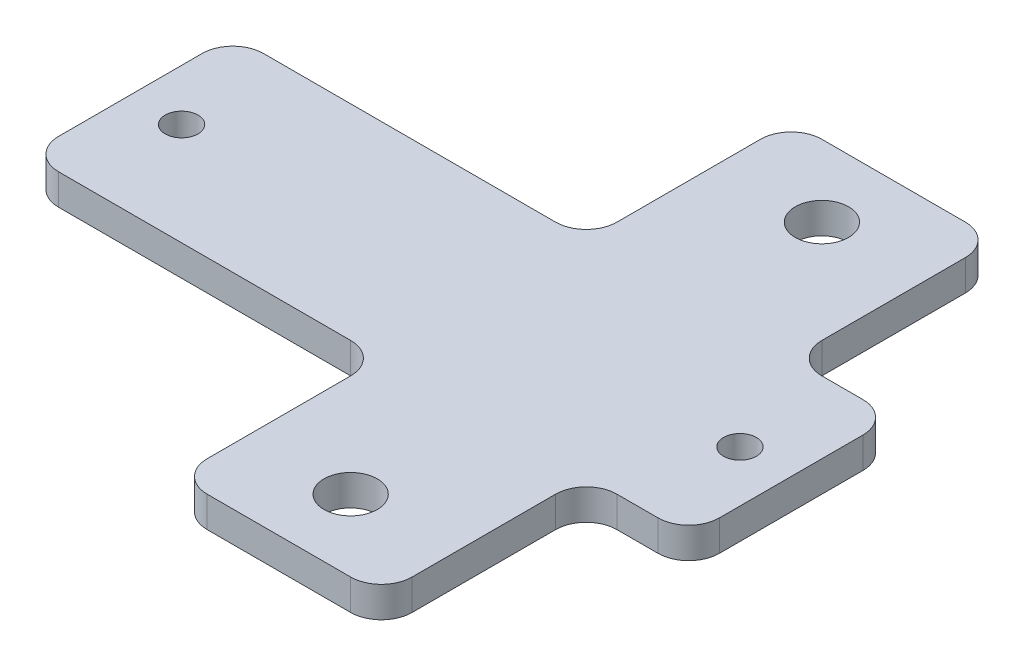
ISO-10303-21;
HEADER;
FILE_DESCRIPTION(('STEP AP214'),'2;1');
FILE_NAME('part.step','',(''),(''),'','','');
FILE_SCHEMA(('AUTOMOTIVE_DESIGN { 1 0 10303 214 1 1 1 1 }'));
ENDSEC;
DATA;
#1=APPLICATION_CONTEXT('core data for automotive mechanical design processes');
#2=APPLICATION_PROTOCOL_DEFINITION('international standard','automotive_design',2000,#1);
#3=PRODUCT_CONTEXT('',#1,'mechanical');
#4=PRODUCT('Part','Part','',(#3));
#5=PRODUCT_RELATED_PRODUCT_CATEGORY('part','',(#4));
#6=PRODUCT_DEFINITION_FORMATION('','',#4);
#7=PRODUCT_DEFINITION_CONTEXT('part definition',#1,'design');
#8=PRODUCT_DEFINITION('design','',#6,#7);
#9=PRODUCT_DEFINITION_SHAPE('','',#8);
#10=(LENGTH_UNIT() NAMED_UNIT(*) SI_UNIT(.MILLI.,.METRE.));
#11=(NAMED_UNIT(*) PLANE_ANGLE_UNIT() SI_UNIT($,.RADIAN.));
#12=(NAMED_UNIT(*) SI_UNIT($,.STERADIAN.) SOLID_ANGLE_UNIT());
#13=UNCERTAINTY_MEASURE_WITH_UNIT(LENGTH_MEASURE(1.E-05),#10,'distance_accuracy_value','');
#14=(GEOMETRIC_REPRESENTATION_CONTEXT(3) GLOBAL_UNCERTAINTY_ASSIGNED_CONTEXT((#13)) GLOBAL_UNIT_ASSIGNED_CONTEXT((#10,
#11,#12)) REPRESENTATION_CONTEXT('',''));
#15=CARTESIAN_POINT('',(0.,0.,0.));
#16=DIRECTION('',(0.,0.,1.));
#17=DIRECTION('',(1.,0.,0.));
#18=AXIS2_PLACEMENT_3D('',#15,#16,#17);
#19=CARTESIAN_POINT('',(20.,3.,0.));
#20=DIRECTION('',(-1.,0.,0.));
#21=DIRECTION('',(0.,0.,1.));
#22=AXIS2_PLACEMENT_3D('',#19,#20,#21);
#23=PLANE('',#22);
#24=DIRECTION('',(0.,0.,-1.));
#25=VECTOR('',#24,1.);
#26=CARTESIAN_POINT('',(20.,0.,0.));
#27=LINE('',#26,#25);
#28=CARTESIAN_POINT('',(20.,0.,-43.));
#29=VERTEX_POINT('',#28);
#30=CARTESIAN_POINT('',(20.,0.,-57.));
#31=VERTEX_POINT('',#30);
#32=EDGE_CURVE('E351',#29,#31,#27,.T.);
#33=ORIENTED_EDGE('',*,*,#32,.T.);
#34=DIRECTION('',(0.,-1.,0.));
#35=VECTOR('',#34,1.);
#36=CARTESIAN_POINT('',(20.,3.,-57.));
#37=LINE('',#36,#35);
#38=CARTESIAN_POINT('',(20.,3.,-57.));
#39=VERTEX_POINT('',#38);
#40=EDGE_CURVE('E242',#31,#39,#37,.F.);
#41=ORIENTED_EDGE('',*,*,#40,.T.);
#42=DIRECTION('',(0.,0.,-1.));
#43=VECTOR('',#42,1.);
#44=CARTESIAN_POINT('',(20.,3.,0.));
#45=LINE('',#44,#43);
#46=CARTESIAN_POINT('',(20.,3.,-43.));
#47=VERTEX_POINT('',#46);
#48=EDGE_CURVE('E340',#47,#39,#45,.T.);
#49=ORIENTED_EDGE('',*,*,#48,.F.);
#50=DIRECTION('',(0.,1.,0.));
#51=VECTOR('',#50,1.);
#52=CARTESIAN_POINT('',(20.,3.,-43.));
#53=LINE('',#52,#51);
#54=EDGE_CURVE('E240',#47,#29,#53,.F.);
#55=ORIENTED_EDGE('',*,*,#54,.T.);
#56=EDGE_LOOP('',(#33,#41,#49,#55));
#57=FACE_BOUND('',#56,.T.);
#58=ADVANCED_FACE('F34',(#57),#23,.F.);
#59=CARTESIAN_POINT('',(0.,3.,0.));
#60=DIRECTION('',(1.,0.,0.));
#61=DIRECTION('',(0.,0.,-1.));
#62=AXIS2_PLACEMENT_3D('',#59,#60,#61);
#63=PLANE('',#62);
#64=DIRECTION('',(0.,0.,1.));
#65=VECTOR('',#64,1.);
#66=CARTESIAN_POINT('',(0.,3.,0.));
#67=LINE('',#66,#65);
#68=CARTESIAN_POINT('',(0.,3.,-17.));
#69=VERTEX_POINT('',#68);
#70=CARTESIAN_POINT('',(0.,3.,-3.));
#71=VERTEX_POINT('',#70);
#72=EDGE_CURVE('E291',#69,#71,#67,.T.);
#73=ORIENTED_EDGE('',*,*,#72,.F.);
#74=DIRECTION('',(0.,1.,0.));
#75=VECTOR('',#74,1.);
#76=CARTESIAN_POINT('',(0.,3.,-17.));
#77=LINE('',#76,#75);
#78=CARTESIAN_POINT('',(0.,0.,-17.));
#79=VERTEX_POINT('',#78);
#80=EDGE_CURVE('E272',#69,#79,#77,.F.);
#81=ORIENTED_EDGE('',*,*,#80,.T.);
#82=DIRECTION('',(0.,0.,1.));
#83=VECTOR('',#82,1.);
#84=CARTESIAN_POINT('',(0.,0.,0.));
#85=LINE('',#84,#83);
#86=CARTESIAN_POINT('',(0.,0.,-3.));
#87=VERTEX_POINT('',#86);
#88=EDGE_CURVE('E311',#79,#87,#85,.T.);
#89=ORIENTED_EDGE('',*,*,#88,.T.);
#90=DIRECTION('',(0.,-1.,0.));
#91=VECTOR('',#90,1.);
#92=CARTESIAN_POINT('',(0.,3.,-3.));
#93=LINE('',#92,#91);
#94=EDGE_CURVE('E270',#87,#71,#93,.F.);
#95=ORIENTED_EDGE('',*,*,#94,.T.);
#96=EDGE_LOOP('',(#73,#81,#89,#95));
#97=FACE_BOUND('',#96,.T.);
#98=ADVANCED_FACE('F300',(#97),#63,.F.);
#99=CARTESIAN_POINT('',(0.,3.,0.));
#100=DIRECTION('',(0.,-1.,0.));
#101=DIRECTION('',(0.,0.,-1.));
#102=AXIS2_PLACEMENT_3D('',#99,#100,#101);
#103=PLANE('',#102);
#104=DIRECTION('',(0.,0.,1.));
#105=VECTOR('',#104,1.);
#106=CARTESIAN_POINT('',(-34.5,3.,-20.));
#107=LINE('',#106,#105);
#108=CARTESIAN_POINT('',(-34.5,3.,-37.));
#109=VERTEX_POINT('',#108);
#110=CARTESIAN_POINT('',(-34.5,3.,-23.));
#111=VERTEX_POINT('',#110);
#112=EDGE_CURVE('E203',#109,#111,#107,.T.);
#113=ORIENTED_EDGE('',*,*,#112,.T.);
#114=CARTESIAN_POINT('',(-31.5,3.,-23.));
#115=DIRECTION('',(0.,-1.,0.));
#116=DIRECTION('',(0.,0.,-1.));
#117=AXIS2_PLACEMENT_3D('',#114,#115,#116);
#118=CIRCLE('',#117,3.);
#119=CARTESIAN_POINT('',(-31.5,3.,-20.));
#120=VERTEX_POINT('',#119);
#121=EDGE_CURVE('E372',#111,#120,#118,.F.);
#122=ORIENTED_EDGE('',*,*,#121,.T.);
#123=DIRECTION('',(1.,0.,0.));
#124=VECTOR('',#123,1.);
#125=CARTESIAN_POINT('',(0.,3.,-20.));
#126=LINE('',#125,#124);
#127=CARTESIAN_POINT('',(-3.,3.,-20.));
#128=VERTEX_POINT('',#127);
#129=EDGE_CURVE('E294',#120,#128,#126,.T.);
#130=ORIENTED_EDGE('',*,*,#129,.T.);
#131=CARTESIAN_POINT('',(-3.,3.,-17.));
#132=DIRECTION('',(0.,-1.,0.));
#133=DIRECTION('',(0.,0.,-1.));
#134=AXIS2_PLACEMENT_3D('',#131,#132,#133);
#135=CIRCLE('',#134,3.);
#136=EDGE_CURVE('E42',#128,#69,#135,.T.);
#137=ORIENTED_EDGE('',*,*,#136,.T.);
#138=ORIENTED_EDGE('',*,*,#72,.T.);
#139=CARTESIAN_POINT('',(3.,3.,-3.));
#140=DIRECTION('',(0.,-1.,0.));
#141=DIRECTION('',(0.,0.,-1.));
#142=AXIS2_PLACEMENT_3D('',#139,#140,#141);
#143=CIRCLE('',#142,3.);
#144=CARTESIAN_POINT('',(3.,3.,0.));
#145=VERTEX_POINT('',#144);
#146=EDGE_CURVE('E358',#71,#145,#143,.F.);
#147=ORIENTED_EDGE('',*,*,#146,.T.);
#148=DIRECTION('',(1.,0.,0.));
#149=VECTOR('',#148,1.);
#150=CARTESIAN_POINT('',(0.,3.,0.));
#151=LINE('',#150,#149);
#152=CARTESIAN_POINT('',(17.,3.,0.));
#153=VERTEX_POINT('',#152);
#154=EDGE_CURVE('E337',#145,#153,#151,.T.);
#155=ORIENTED_EDGE('',*,*,#154,.T.);
#156=CARTESIAN_POINT('',(17.,3.,-3.));
#157=DIRECTION('',(0.,-1.,0.));
#158=DIRECTION('',(0.,0.,-1.));
#159=AXIS2_PLACEMENT_3D('',#156,#157,#158);
#160=CIRCLE('',#159,3.);
#161=CARTESIAN_POINT('',(20.,3.,-3.));
#162=VERTEX_POINT('',#161);
#163=EDGE_CURVE('E360',#153,#162,#160,.F.);
#164=ORIENTED_EDGE('',*,*,#163,.T.);
#165=CARTESIAN_POINT('',(20.,3.,-17.));
#166=VERTEX_POINT('',#165);
#167=EDGE_CURVE('E343',#162,#166,#45,.T.);
#168=ORIENTED_EDGE('',*,*,#167,.T.);
#169=CARTESIAN_POINT('',(23.,3.,-17.));
#170=DIRECTION('',(0.,-1.,0.));
#171=DIRECTION('',(0.,0.,-1.));
#172=AXIS2_PLACEMENT_3D('',#169,#170,#171);
#173=CIRCLE('',#172,3.);
#174=CARTESIAN_POINT('',(23.,3.,-20.));
#175=VERTEX_POINT('',#174);
#176=EDGE_CURVE('E282',#166,#175,#173,.T.);
#177=ORIENTED_EDGE('',*,*,#176,.T.);
#178=DIRECTION('',(1.,0.,0.));
#179=VECTOR('',#178,1.);
#180=CARTESIAN_POINT('',(20.,3.,-20.));
#181=LINE('',#180,#179);
#182=CARTESIAN_POINT('',(27.,3.,-20.));
#183=VERTEX_POINT('',#182);
#184=EDGE_CURVE('E438',#175,#183,#181,.T.);
#185=ORIENTED_EDGE('',*,*,#184,.T.);
#186=CARTESIAN_POINT('',(27.,3.,-23.));
#187=DIRECTION('',(0.,-1.,0.));
#188=DIRECTION('',(0.,0.,-1.));
#189=AXIS2_PLACEMENT_3D('',#186,#187,#188);
#190=CIRCLE('',#189,3.);
#191=CARTESIAN_POINT('',(30.,3.,-23.));
#192=VERTEX_POINT('',#191);
#193=EDGE_CURVE('E362',#183,#192,#190,.F.);
#194=ORIENTED_EDGE('',*,*,#193,.T.);
#195=DIRECTION('',(0.,0.,-1.));
#196=VECTOR('',#195,1.);
#197=CARTESIAN_POINT('',(30.,3.,-20.));
#198=LINE('',#197,#196);
#199=CARTESIAN_POINT('',(30.,3.,-37.));
#200=VERTEX_POINT('',#199);
#201=EDGE_CURVE('E441',#192,#200,#198,.T.);
#202=ORIENTED_EDGE('',*,*,#201,.T.);
#203=CARTESIAN_POINT('',(27.,3.,-37.));
#204=DIRECTION('',(0.,-1.,0.));
#205=DIRECTION('',(0.,0.,-1.));
#206=AXIS2_PLACEMENT_3D('',#203,#204,#205);
#207=CIRCLE('',#206,3.);
#208=CARTESIAN_POINT('',(27.,3.,-40.));
#209=VERTEX_POINT('',#208);
#210=EDGE_CURVE('E364',#200,#209,#207,.F.);
#211=ORIENTED_EDGE('',*,*,#210,.T.);
#212=DIRECTION('',(-1.,0.,0.));
#213=VECTOR('',#212,1.);
#214=CARTESIAN_POINT('',(20.,3.,-40.));
#215=LINE('',#214,#213);
#216=CARTESIAN_POINT('',(23.,3.,-40.));
#217=VERTEX_POINT('',#216);
#218=EDGE_CURVE('E319',#209,#217,#215,.T.);
#219=ORIENTED_EDGE('',*,*,#218,.T.);
#220=CARTESIAN_POINT('',(23.,3.,-43.));
#221=DIRECTION('',(0.,-1.,0.));
#222=DIRECTION('',(0.,0.,-1.));
#223=AXIS2_PLACEMENT_3D('',#220,#221,#222);
#224=CIRCLE('',#223,3.);
#225=EDGE_CURVE('E278',#217,#47,#224,.T.);
#226=ORIENTED_EDGE('',*,*,#225,.T.);
#227=ORIENTED_EDGE('',*,*,#48,.T.);
#228=CARTESIAN_POINT('',(17.,3.,-57.));
#229=DIRECTION('',(0.,-1.,0.));
#230=DIRECTION('',(0.,0.,-1.));
#231=AXIS2_PLACEMENT_3D('',#228,#229,#230);
#232=CIRCLE('',#231,3.);
#233=CARTESIAN_POINT('',(17.,3.,-60.));
#234=VERTEX_POINT('',#233);
#235=EDGE_CURVE('E366',#39,#234,#232,.F.);
#236=ORIENTED_EDGE('',*,*,#235,.T.);
#237=DIRECTION('',(-1.,0.,0.));
#238=VECTOR('',#237,1.);
#239=CARTESIAN_POINT('',(0.,3.,-60.));
#240=LINE('',#239,#238);
#241=CARTESIAN_POINT('',(3.,3.,-60.));
#242=VERTEX_POINT('',#241);
#243=EDGE_CURVE('E206',#234,#242,#240,.T.);
#244=ORIENTED_EDGE('',*,*,#243,.T.);
#245=CARTESIAN_POINT('',(3.,3.,-57.));
#246=DIRECTION('',(0.,-1.,0.));
#247=DIRECTION('',(0.,0.,-1.));
#248=AXIS2_PLACEMENT_3D('',#245,#246,#247);
#249=CIRCLE('',#248,3.);
#250=CARTESIAN_POINT('',(0.,3.,-57.));
#251=VERTEX_POINT('',#250);
#252=EDGE_CURVE('E368',#242,#251,#249,.F.);
#253=ORIENTED_EDGE('',*,*,#252,.T.);
#254=CARTESIAN_POINT('',(0.,3.,-43.));
#255=VERTEX_POINT('',#254);
#256=EDGE_CURVE('E304',#251,#255,#67,.T.);
#257=ORIENTED_EDGE('',*,*,#256,.T.);
#258=CARTESIAN_POINT('',(-3.,3.,-43.));
#259=DIRECTION('',(0.,-1.,0.));
#260=DIRECTION('',(0.,0.,-1.));
#261=AXIS2_PLACEMENT_3D('',#258,#259,#260);
#262=CIRCLE('',#261,3.);
#263=CARTESIAN_POINT('',(-3.,3.,-40.));
#264=VERTEX_POINT('',#263);
#265=EDGE_CURVE('E274',#255,#264,#262,.T.);
#266=ORIENTED_EDGE('',*,*,#265,.T.);
#267=DIRECTION('',(-1.,0.,0.));
#268=VECTOR('',#267,1.);
#269=CARTESIAN_POINT('',(0.,3.,-40.));
#270=LINE('',#269,#268);
#271=CARTESIAN_POINT('',(-31.5,3.,-40.));
#272=VERTEX_POINT('',#271);
#273=EDGE_CURVE('E414',#264,#272,#270,.T.);
#274=ORIENTED_EDGE('',*,*,#273,.T.);
#275=CARTESIAN_POINT('',(-31.5,3.,-37.));
#276=DIRECTION('',(0.,-1.,0.));
#277=DIRECTION('',(0.,0.,-1.));
#278=AXIS2_PLACEMENT_3D('',#275,#276,#277);
#279=CIRCLE('',#278,3.);
#280=EDGE_CURVE('E370',#272,#109,#279,.F.);
#281=ORIENTED_EDGE('',*,*,#280,.T.);
#282=EDGE_LOOP('',(#113,#122,#130,#137,#138,#147,#155,#164,#168,#177,#185,#194,#202,#211,#219,
#226,#227,#236,#244,#253,#257,#266,#274,#281));
#283=FACE_BOUND('',#282,.T.);
#284=CARTESIAN_POINT('',(10.,3.,-7.));
#285=DIRECTION('',(0.,1.,0.));
#286=DIRECTION('',(0.,0.,1.));
#287=AXIS2_PLACEMENT_3D('',#284,#285,#286);
#288=CIRCLE('',#287,2.6);
#289=CARTESIAN_POINT('',(10.,3.,-4.4));
#290=VERTEX_POINT('',#289);
#291=EDGE_CURVE('E332',#290,#290,#288,.T.);
#292=ORIENTED_EDGE('',*,*,#291,.F.);
#293=EDGE_LOOP('',(#292));
#294=FACE_BOUND('',#293,.T.);
#295=CARTESIAN_POINT('',(10.,3.,-53.));
#296=DIRECTION('',(0.,1.,0.));
#297=DIRECTION('',(0.,0.,-1.));
#298=AXIS2_PLACEMENT_3D('',#295,#296,#297);
#299=CIRCLE('',#298,2.6);
#300=CARTESIAN_POINT('',(10.,3.,-55.6));
#301=VERTEX_POINT('',#300);
#302=EDGE_CURVE('E324',#301,#301,#299,.T.);
#303=ORIENTED_EDGE('',*,*,#302,.F.);
#304=EDGE_LOOP('',(#303));
#305=FACE_BOUND('',#304,.T.);
#306=CARTESIAN_POINT('',(-29.5,3.,-30.));
#307=DIRECTION('',(0.,1.,0.));
#308=DIRECTION('',(0.,0.,1.));
#309=AXIS2_PLACEMENT_3D('',#306,#307,#308);
#310=CIRCLE('',#309,1.6);
#311=CARTESIAN_POINT('',(-29.5,3.,-28.4));
#312=VERTEX_POINT('',#311);
#313=EDGE_CURVE('E416',#312,#312,#310,.T.);
#314=ORIENTED_EDGE('',*,*,#313,.F.);
#315=EDGE_LOOP('',(#314));
#316=FACE_BOUND('',#315,.T.);
#317=CARTESIAN_POINT('',(25.,3.,-30.));
#318=DIRECTION('',(0.,1.,0.));
#319=DIRECTION('',(0.,0.,1.));
#320=AXIS2_PLACEMENT_3D('',#317,#318,#319);
#321=CIRCLE('',#320,1.6);
#322=CARTESIAN_POINT('',(25.,3.,-28.4));
#323=VERTEX_POINT('',#322);
#324=EDGE_CURVE('E434',#323,#323,#321,.T.);
#325=ORIENTED_EDGE('',*,*,#324,.F.);
#326=EDGE_LOOP('',(#325));
#327=FACE_BOUND('',#326,.T.);
#328=ADVANCED_FACE('F289',(#283,#294,#305,#316,#327),#103,.F.);
#329=CARTESIAN_POINT('',(0.,0.,0.));
#330=DIRECTION('',(0.,-1.,0.));
#331=DIRECTION('',(0.,0.,-1.));
#332=AXIS2_PLACEMENT_3D('',#329,#330,#331);
#333=PLANE('',#332);
#334=CARTESIAN_POINT('',(10.,0.,-7.));
#335=DIRECTION('',(0.,1.,0.));
#336=DIRECTION('',(0.,0.,1.));
#337=AXIS2_PLACEMENT_3D('',#334,#335,#336);
#338=CIRCLE('',#337,2.6);
#339=CARTESIAN_POINT('',(10.,0.,-4.4));
#340=VERTEX_POINT('',#339);
#341=EDGE_CURVE('E327',#340,#340,#338,.T.);
#342=ORIENTED_EDGE('',*,*,#341,.T.);
#343=EDGE_LOOP('',(#342));
#344=FACE_BOUND('',#343,.T.);
#345=DIRECTION('',(1.,0.,0.));
#346=VECTOR('',#345,1.);
#347=CARTESIAN_POINT('',(0.,0.,-20.));
#348=LINE('',#347,#346);
#349=CARTESIAN_POINT('',(-31.5,0.,-20.));
#350=VERTEX_POINT('',#349);
#351=CARTESIAN_POINT('',(-3.,0.,-20.));
#352=VERTEX_POINT('',#351);
#353=EDGE_CURVE('E214',#350,#352,#348,.T.);
#354=ORIENTED_EDGE('',*,*,#353,.F.);
#355=CARTESIAN_POINT('',(-31.5,0.,-23.));
#356=DIRECTION('',(0.,-1.,0.));
#357=DIRECTION('',(0.,0.,-1.));
#358=AXIS2_PLACEMENT_3D('',#355,#356,#357);
#359=CIRCLE('',#358,3.);
#360=CARTESIAN_POINT('',(-34.5,0.,-23.));
#361=VERTEX_POINT('',#360);
#362=EDGE_CURVE('E212',#350,#361,#359,.T.);
#363=ORIENTED_EDGE('',*,*,#362,.T.);
#364=DIRECTION('',(0.,0.,1.));
#365=VECTOR('',#364,1.);
#366=CARTESIAN_POINT('',(-34.5,0.,-20.));
#367=LINE('',#366,#365);
#368=CARTESIAN_POINT('',(-34.5,0.,-37.));
#369=VERTEX_POINT('',#368);
#370=EDGE_CURVE('E200',#369,#361,#367,.T.);
#371=ORIENTED_EDGE('',*,*,#370,.F.);
#372=CARTESIAN_POINT('',(-31.5,0.,-37.));
#373=DIRECTION('',(0.,-1.,0.));
#374=DIRECTION('',(0.,0.,-1.));
#375=AXIS2_PLACEMENT_3D('',#372,#373,#374);
#376=CIRCLE('',#375,3.);
#377=CARTESIAN_POINT('',(-31.5,0.,-40.));
#378=VERTEX_POINT('',#377);
#379=EDGE_CURVE('E49',#369,#378,#376,.T.);
#380=ORIENTED_EDGE('',*,*,#379,.T.);
#381=DIRECTION('',(-1.,0.,0.));
#382=VECTOR('',#381,1.);
#383=CARTESIAN_POINT('',(0.,0.,-40.));
#384=LINE('',#383,#382);
#385=CARTESIAN_POINT('',(-3.,0.,-40.));
#386=VERTEX_POINT('',#385);
#387=EDGE_CURVE('E213',#386,#378,#384,.T.);
#388=ORIENTED_EDGE('',*,*,#387,.F.);
#389=CARTESIAN_POINT('',(-3.,0.,-43.));
#390=DIRECTION('',(0.,-1.,0.));
#391=DIRECTION('',(0.,0.,-1.));
#392=AXIS2_PLACEMENT_3D('',#389,#390,#391);
#393=CIRCLE('',#392,3.);
#394=CARTESIAN_POINT('',(0.,0.,-43.));
#395=VERTEX_POINT('',#394);
#396=EDGE_CURVE('E276',#386,#395,#393,.F.);
#397=ORIENTED_EDGE('',*,*,#396,.T.);
#398=CARTESIAN_POINT('',(0.,0.,-57.));
#399=VERTEX_POINT('',#398);
#400=EDGE_CURVE('E347',#399,#395,#85,.T.);
#401=ORIENTED_EDGE('',*,*,#400,.F.);
#402=CARTESIAN_POINT('',(3.,0.,-57.));
#403=DIRECTION('',(0.,-1.,0.));
#404=DIRECTION('',(0.,0.,-1.));
#405=AXIS2_PLACEMENT_3D('',#402,#403,#404);
#406=CIRCLE('',#405,3.);
#407=CARTESIAN_POINT('',(3.,0.,-60.));
#408=VERTEX_POINT('',#407);
#409=EDGE_CURVE('E220',#399,#408,#406,.T.);
#410=ORIENTED_EDGE('',*,*,#409,.T.);
#411=DIRECTION('',(-1.,0.,0.));
#412=VECTOR('',#411,1.);
#413=CARTESIAN_POINT('',(0.,0.,-60.));
#414=LINE('',#413,#412);
#415=CARTESIAN_POINT('',(17.,0.,-60.));
#416=VERTEX_POINT('',#415);
#417=EDGE_CURVE('E305',#416,#408,#414,.T.);
#418=ORIENTED_EDGE('',*,*,#417,.F.);
#419=CARTESIAN_POINT('',(17.,0.,-57.));
#420=DIRECTION('',(0.,-1.,0.));
#421=DIRECTION('',(0.,0.,-1.));
#422=AXIS2_PLACEMENT_3D('',#419,#420,#421);
#423=CIRCLE('',#422,3.);
#424=EDGE_CURVE('E223',#416,#31,#423,.T.);
#425=ORIENTED_EDGE('',*,*,#424,.T.);
#426=ORIENTED_EDGE('',*,*,#32,.F.);
#427=CARTESIAN_POINT('',(23.,0.,-43.));
#428=DIRECTION('',(0.,-1.,0.));
#429=DIRECTION('',(0.,0.,-1.));
#430=AXIS2_PLACEMENT_3D('',#427,#428,#429);
#431=CIRCLE('',#430,3.);
#432=CARTESIAN_POINT('',(23.,0.,-40.));
#433=VERTEX_POINT('',#432);
#434=EDGE_CURVE('E280',#29,#433,#431,.F.);
#435=ORIENTED_EDGE('',*,*,#434,.T.);
#436=DIRECTION('',(-1.,0.,0.));
#437=VECTOR('',#436,1.);
#438=CARTESIAN_POINT('',(20.,0.,-40.));
#439=LINE('',#438,#437);
#440=CARTESIAN_POINT('',(27.,0.,-40.));
#441=VERTEX_POINT('',#440);
#442=EDGE_CURVE('E430',#441,#433,#439,.T.);
#443=ORIENTED_EDGE('',*,*,#442,.F.);
#444=CARTESIAN_POINT('',(27.,0.,-37.));
#445=DIRECTION('',(0.,-1.,0.));
#446=DIRECTION('',(0.,0.,-1.));
#447=AXIS2_PLACEMENT_3D('',#444,#445,#446);
#448=CIRCLE('',#447,3.);
#449=CARTESIAN_POINT('',(30.,0.,-37.));
#450=VERTEX_POINT('',#449);
#451=EDGE_CURVE('E382',#441,#450,#448,.T.);
#452=ORIENTED_EDGE('',*,*,#451,.T.);
#453=DIRECTION('',(0.,0.,-1.));
#454=VECTOR('',#453,1.);
#455=CARTESIAN_POINT('',(30.,0.,-20.));
#456=LINE('',#455,#454);
#457=CARTESIAN_POINT('',(30.,0.,-23.));
#458=VERTEX_POINT('',#457);
#459=EDGE_CURVE('E426',#458,#450,#456,.T.);
#460=ORIENTED_EDGE('',*,*,#459,.F.);
#461=CARTESIAN_POINT('',(27.,0.,-23.));
#462=DIRECTION('',(0.,-1.,0.));
#463=DIRECTION('',(0.,0.,-1.));
#464=AXIS2_PLACEMENT_3D('',#461,#462,#463);
#465=CIRCLE('',#464,3.);
#466=CARTESIAN_POINT('',(27.,0.,-20.));
#467=VERTEX_POINT('',#466);
#468=EDGE_CURVE('E380',#458,#467,#465,.T.);
#469=ORIENTED_EDGE('',*,*,#468,.T.);
#470=DIRECTION('',(1.,0.,0.));
#471=VECTOR('',#470,1.);
#472=CARTESIAN_POINT('',(20.,0.,-20.));
#473=LINE('',#472,#471);
#474=CARTESIAN_POINT('',(23.,0.,-20.));
#475=VERTEX_POINT('',#474);
#476=EDGE_CURVE('E429',#475,#467,#473,.T.);
#477=ORIENTED_EDGE('',*,*,#476,.F.);
#478=CARTESIAN_POINT('',(23.,0.,-17.));
#479=DIRECTION('',(0.,-1.,0.));
#480=DIRECTION('',(0.,0.,-1.));
#481=AXIS2_PLACEMENT_3D('',#478,#479,#480);
#482=CIRCLE('',#481,3.);
#483=CARTESIAN_POINT('',(20.,0.,-17.));
#484=VERTEX_POINT('',#483);
#485=EDGE_CURVE('E284',#475,#484,#482,.F.);
#486=ORIENTED_EDGE('',*,*,#485,.T.);
#487=CARTESIAN_POINT('',(20.,0.,-3.));
#488=VERTEX_POINT('',#487);
#489=EDGE_CURVE('E352',#488,#484,#27,.T.);
#490=ORIENTED_EDGE('',*,*,#489,.F.);
#491=CARTESIAN_POINT('',(17.,0.,-3.));
#492=DIRECTION('',(0.,-1.,0.));
#493=DIRECTION('',(0.,0.,-1.));
#494=AXIS2_PLACEMENT_3D('',#491,#492,#493);
#495=CIRCLE('',#494,3.);
#496=CARTESIAN_POINT('',(17.,0.,0.));
#497=VERTEX_POINT('',#496);
#498=EDGE_CURVE('E378',#488,#497,#495,.T.);
#499=ORIENTED_EDGE('',*,*,#498,.T.);
#500=DIRECTION('',(1.,0.,0.));
#501=VECTOR('',#500,1.);
#502=CARTESIAN_POINT('',(0.,0.,0.));
#503=LINE('',#502,#501);
#504=CARTESIAN_POINT('',(3.,0.,0.));
#505=VERTEX_POINT('',#504);
#506=EDGE_CURVE('E348',#505,#497,#503,.T.);
#507=ORIENTED_EDGE('',*,*,#506,.F.);
#508=CARTESIAN_POINT('',(3.,0.,-3.));
#509=DIRECTION('',(0.,-1.,0.));
#510=DIRECTION('',(0.,0.,-1.));
#511=AXIS2_PLACEMENT_3D('',#508,#509,#510);
#512=CIRCLE('',#511,3.);
#513=EDGE_CURVE('E376',#505,#87,#512,.T.);
#514=ORIENTED_EDGE('',*,*,#513,.T.);
#515=ORIENTED_EDGE('',*,*,#88,.F.);
#516=CARTESIAN_POINT('',(-3.,0.,-17.));
#517=DIRECTION('',(0.,-1.,0.));
#518=DIRECTION('',(0.,0.,-1.));
#519=AXIS2_PLACEMENT_3D('',#516,#517,#518);
#520=CIRCLE('',#519,3.);
#521=EDGE_CURVE('E11',#79,#352,#520,.F.);
#522=ORIENTED_EDGE('',*,*,#521,.T.);
#523=EDGE_LOOP('',(#354,#363,#371,#380,#388,#397,#401,#410,#418,#425,#426,#435,#443,#452,#460,
#469,#477,#486,#490,#499,#507,#514,#515,#522));
#524=FACE_BOUND('',#523,.T.);
#525=CARTESIAN_POINT('',(10.,0.,-53.));
#526=DIRECTION('',(0.,1.,0.));
#527=DIRECTION('',(0.,0.,-1.));
#528=AXIS2_PLACEMENT_3D('',#525,#526,#527);
#529=CIRCLE('',#528,2.6);
#530=CARTESIAN_POINT('',(10.,0.,-55.6));
#531=VERTEX_POINT('',#530);
#532=EDGE_CURVE('E328',#531,#531,#529,.T.);
#533=ORIENTED_EDGE('',*,*,#532,.T.);
#534=EDGE_LOOP('',(#533));
#535=FACE_BOUND('',#534,.T.);
#536=CARTESIAN_POINT('',(-29.5,0.,-30.));
#537=DIRECTION('',(0.,-1.,0.));
#538=DIRECTION('',(0.,0.,-1.));
#539=AXIS2_PLACEMENT_3D('',#536,#537,#538);
#540=CIRCLE('',#539,1.6);
#541=CARTESIAN_POINT('',(-29.5,0.,-31.6));
#542=VERTEX_POINT('',#541);
#543=EDGE_CURVE('E331',#542,#542,#540,.F.);
#544=ORIENTED_EDGE('',*,*,#543,.T.);
#545=EDGE_LOOP('',(#544));
#546=FACE_BOUND('',#545,.T.);
#547=CARTESIAN_POINT('',(25.,0.,-30.));
#548=DIRECTION('',(0.,-1.,0.));
#549=DIRECTION('',(0.,0.,-1.));
#550=AXIS2_PLACEMENT_3D('',#547,#548,#549);
#551=CIRCLE('',#550,1.6);
#552=CARTESIAN_POINT('',(25.,0.,-31.6));
#553=VERTEX_POINT('',#552);
#554=EDGE_CURVE('E316',#553,#553,#551,.F.);
#555=ORIENTED_EDGE('',*,*,#554,.T.);
#556=EDGE_LOOP('',(#555));
#557=FACE_BOUND('',#556,.T.);
#558=ADVANCED_FACE('F209',(#344,#524,#535,#546,#557),#333,.T.);
#559=ORIENTED_EDGE('',*,*,#400,.T.);
#560=DIRECTION('',(0.,1.,0.));
#561=VECTOR('',#560,1.);
#562=CARTESIAN_POINT('',(0.,3.,-43.));
#563=LINE('',#562,#561);
#564=EDGE_CURVE('E232',#395,#255,#563,.T.);
#565=ORIENTED_EDGE('',*,*,#564,.T.);
#566=ORIENTED_EDGE('',*,*,#256,.F.);
#567=DIRECTION('',(0.,-1.,0.));
#568=VECTOR('',#567,1.);
#569=CARTESIAN_POINT('',(0.,3.,-57.));
#570=LINE('',#569,#568);
#571=EDGE_CURVE('E229',#251,#399,#570,.T.);
#572=ORIENTED_EDGE('',*,*,#571,.T.);
#573=EDGE_LOOP('',(#559,#565,#566,#572));
#574=FACE_BOUND('',#573,.T.);
#575=ADVANCED_FACE('F407',(#574),#63,.F.);
#576=CARTESIAN_POINT('',(0.,3.,0.));
#577=DIRECTION('',(0.,0.,-1.));
#578=DIRECTION('',(-1.,0.,0.));
#579=AXIS2_PLACEMENT_3D('',#576,#577,#578);
#580=PLANE('',#579);
#581=ORIENTED_EDGE('',*,*,#506,.T.);
#582=DIRECTION('',(0.,-1.,0.));
#583=VECTOR('',#582,1.);
#584=CARTESIAN_POINT('',(17.,3.,0.));
#585=LINE('',#584,#583);
#586=EDGE_CURVE('E268',#497,#153,#585,.F.);
#587=ORIENTED_EDGE('',*,*,#586,.T.);
#588=ORIENTED_EDGE('',*,*,#154,.F.);
#589=DIRECTION('',(0.,-1.,0.));
#590=VECTOR('',#589,1.);
#591=CARTESIAN_POINT('',(3.,3.,0.));
#592=LINE('',#591,#590);
#593=EDGE_CURVE('E265',#145,#505,#592,.T.);
#594=ORIENTED_EDGE('',*,*,#593,.T.);
#595=EDGE_LOOP('',(#581,#587,#588,#594));
#596=FACE_BOUND('',#595,.T.);
#597=ADVANCED_FACE('F485',(#596),#580,.F.);
#598=ORIENTED_EDGE('',*,*,#489,.T.);
#599=DIRECTION('',(0.,1.,0.));
#600=VECTOR('',#599,1.);
#601=CARTESIAN_POINT('',(20.,3.,-17.));
#602=LINE('',#601,#600);
#603=EDGE_CURVE('E257',#484,#166,#602,.T.);
#604=ORIENTED_EDGE('',*,*,#603,.T.);
#605=ORIENTED_EDGE('',*,*,#167,.F.);
#606=DIRECTION('',(0.,-1.,0.));
#607=VECTOR('',#606,1.);
#608=CARTESIAN_POINT('',(20.,3.,-3.));
#609=LINE('',#608,#607);
#610=EDGE_CURVE('E254',#162,#488,#609,.T.);
#611=ORIENTED_EDGE('',*,*,#610,.T.);
#612=EDGE_LOOP('',(#598,#604,#605,#611));
#613=FACE_BOUND('',#612,.T.);
#614=ADVANCED_FACE('F475',(#613),#23,.F.);
#615=CARTESIAN_POINT('',(0.,3.,-60.));
#616=DIRECTION('',(0.,0.,1.));
#617=DIRECTION('',(1.,0.,0.));
#618=AXIS2_PLACEMENT_3D('',#615,#616,#617);
#619=PLANE('',#618);
#620=ORIENTED_EDGE('',*,*,#417,.T.);
#621=DIRECTION('',(0.,-1.,0.));
#622=VECTOR('',#621,1.);
#623=CARTESIAN_POINT('',(3.,3.,-60.));
#624=LINE('',#623,#622);
#625=EDGE_CURVE('E238',#408,#242,#624,.F.);
#626=ORIENTED_EDGE('',*,*,#625,.T.);
#627=ORIENTED_EDGE('',*,*,#243,.F.);
#628=DIRECTION('',(0.,-1.,0.));
#629=VECTOR('',#628,1.);
#630=CARTESIAN_POINT('',(17.,3.,-60.));
#631=LINE('',#630,#629);
#632=EDGE_CURVE('E235',#234,#416,#631,.T.);
#633=ORIENTED_EDGE('',*,*,#632,.T.);
#634=EDGE_LOOP('',(#620,#626,#627,#633));
#635=FACE_BOUND('',#634,.T.);
#636=ADVANCED_FACE('F398',(#635),#619,.F.);
#637=CARTESIAN_POINT('',(10.,3.,-7.));
#638=DIRECTION('',(0.,-1.,0.));
#639=DIRECTION('',(0.,0.,-1.));
#640=AXIS2_PLACEMENT_3D('',#637,#638,#639);
#641=CYLINDRICAL_SURFACE('',#640,2.6);
#642=ORIENTED_EDGE('',*,*,#291,.T.);
#643=EDGE_LOOP('',(#642));
#644=FACE_BOUND('',#643,.T.);
#645=ORIENTED_EDGE('',*,*,#341,.F.);
#646=EDGE_LOOP('',(#645));
#647=FACE_BOUND('',#646,.T.);
#648=ADVANCED_FACE('F506',(#644,#647),#641,.F.);
#649=CARTESIAN_POINT('',(10.,3.,-53.));
#650=DIRECTION('',(0.,-1.,0.));
#651=DIRECTION('',(0.,0.,-1.));
#652=AXIS2_PLACEMENT_3D('',#649,#650,#651);
#653=CYLINDRICAL_SURFACE('',#652,2.6);
#654=ORIENTED_EDGE('',*,*,#302,.T.);
#655=EDGE_LOOP('',(#654));
#656=FACE_BOUND('',#655,.T.);
#657=ORIENTED_EDGE('',*,*,#532,.F.);
#658=EDGE_LOOP('',(#657));
#659=FACE_BOUND('',#658,.T.);
#660=ADVANCED_FACE('F656',(#656,#659),#653,.F.);
#661=CARTESIAN_POINT('',(0.,-39.8779387631808,-20.));
#662=DIRECTION('',(0.,0.,1.));
#663=DIRECTION('',(1.,0.,0.));
#664=AXIS2_PLACEMENT_3D('',#661,#662,#663);
#665=PLANE('',#664);
#666=ORIENTED_EDGE('',*,*,#129,.F.);
#667=DIRECTION('',(0.,1.,0.));
#668=VECTOR('',#667,1.);
#669=CARTESIAN_POINT('',(-31.5,-39.8779387631808,-20.));
#670=LINE('',#669,#668);
#671=EDGE_CURVE('E315',#120,#350,#670,.F.);
#672=ORIENTED_EDGE('',*,*,#671,.T.);
#673=ORIENTED_EDGE('',*,*,#353,.T.);
#674=DIRECTION('',(0.,1.,0.));
#675=VECTOR('',#674,1.);
#676=CARTESIAN_POINT('',(-3.,-39.8779387631808,-20.));
#677=LINE('',#676,#675);
#678=EDGE_CURVE('E309',#352,#128,#677,.T.);
#679=ORIENTED_EDGE('',*,*,#678,.T.);
#680=EDGE_LOOP('',(#666,#672,#673,#679));
#681=FACE_BOUND('',#680,.T.);
#682=ADVANCED_FACE('F313',(#681),#665,.T.);
#683=CARTESIAN_POINT('',(-34.5,-39.8779387631808,-20.));
#684=DIRECTION('',(-1.,0.,0.));
#685=DIRECTION('',(0.,0.,1.));
#686=AXIS2_PLACEMENT_3D('',#683,#684,#685);
#687=PLANE('',#686);
#688=ORIENTED_EDGE('',*,*,#370,.T.);
#689=DIRECTION('',(0.,1.,0.));
#690=VECTOR('',#689,1.);
#691=CARTESIAN_POINT('',(-34.5,-39.8779387631808,-23.));
#692=LINE('',#691,#690);
#693=EDGE_CURVE('E205',#361,#111,#692,.T.);
#694=ORIENTED_EDGE('',*,*,#693,.T.);
#695=ORIENTED_EDGE('',*,*,#112,.F.);
#696=DIRECTION('',(0.,1.,0.));
#697=VECTOR('',#696,1.);
#698=CARTESIAN_POINT('',(-34.5,-39.8779387631808,-37.));
#699=LINE('',#698,#697);
#700=EDGE_CURVE('E197',#109,#369,#699,.F.);
#701=ORIENTED_EDGE('',*,*,#700,.T.);
#702=EDGE_LOOP('',(#688,#694,#695,#701));
#703=FACE_BOUND('',#702,.T.);
#704=ADVANCED_FACE('F198',(#703),#687,.T.);
#705=CARTESIAN_POINT('',(0.,-39.8779387631808,-40.));
#706=DIRECTION('',(0.,0.,-1.));
#707=DIRECTION('',(-1.,0.,0.));
#708=AXIS2_PLACEMENT_3D('',#705,#706,#707);
#709=PLANE('',#708);
#710=ORIENTED_EDGE('',*,*,#387,.T.);
#711=DIRECTION('',(0.,1.,0.));
#712=VECTOR('',#711,1.);
#713=CARTESIAN_POINT('',(-31.5,-39.8779387631808,-40.));
#714=LINE('',#713,#712);
#715=EDGE_CURVE('E219',#378,#272,#714,.T.);
#716=ORIENTED_EDGE('',*,*,#715,.T.);
#717=ORIENTED_EDGE('',*,*,#273,.F.);
#718=DIRECTION('',(0.,1.,0.));
#719=VECTOR('',#718,1.);
#720=CARTESIAN_POINT('',(-3.,-39.8779387631808,-40.));
#721=LINE('',#720,#719);
#722=EDGE_CURVE('E56',#264,#386,#721,.F.);
#723=ORIENTED_EDGE('',*,*,#722,.T.);
#724=EDGE_LOOP('',(#710,#716,#717,#723));
#725=FACE_BOUND('',#724,.T.);
#726=ADVANCED_FACE('F415',(#725),#709,.T.);
#727=CARTESIAN_POINT('',(-29.5,-39.8779387631808,-30.));
#728=DIRECTION('',(0.,1.,0.));
#729=DIRECTION('',(0.,0.,1.));
#730=AXIS2_PLACEMENT_3D('',#727,#728,#729);
#731=CYLINDRICAL_SURFACE('',#730,1.6);
#732=ORIENTED_EDGE('',*,*,#313,.T.);
#733=EDGE_LOOP('',(#732));
#734=FACE_BOUND('',#733,.T.);
#735=ORIENTED_EDGE('',*,*,#543,.F.);
#736=EDGE_LOOP('',(#735));
#737=FACE_BOUND('',#736,.T.);
#738=ADVANCED_FACE('F626',(#734,#737),#731,.F.);
#739=CARTESIAN_POINT('',(20.,-39.8779387631808,-40.));
#740=DIRECTION('',(0.,0.,-1.));
#741=DIRECTION('',(-1.,0.,0.));
#742=AXIS2_PLACEMENT_3D('',#739,#740,#741);
#743=PLANE('',#742);
#744=ORIENTED_EDGE('',*,*,#442,.T.);
#745=DIRECTION('',(0.,1.,0.));
#746=VECTOR('',#745,1.);
#747=CARTESIAN_POINT('',(23.,-39.8779387631808,-40.));
#748=LINE('',#747,#746);
#749=EDGE_CURVE('E246',#433,#217,#748,.T.);
#750=ORIENTED_EDGE('',*,*,#749,.T.);
#751=ORIENTED_EDGE('',*,*,#218,.F.);
#752=DIRECTION('',(0.,1.,0.));
#753=VECTOR('',#752,1.);
#754=CARTESIAN_POINT('',(27.,-39.8779387631808,-40.));
#755=LINE('',#754,#753);
#756=EDGE_CURVE('E244',#209,#441,#755,.F.);
#757=ORIENTED_EDGE('',*,*,#756,.T.);
#758=EDGE_LOOP('',(#744,#750,#751,#757));
#759=FACE_BOUND('',#758,.T.);
#760=ADVANCED_FACE('F448',(#759),#743,.T.);
#761=CARTESIAN_POINT('',(30.,-39.8779387631808,-20.));
#762=DIRECTION('',(1.,0.,0.));
#763=DIRECTION('',(0.,0.,-1.));
#764=AXIS2_PLACEMENT_3D('',#761,#762,#763);
#765=PLANE('',#764);
#766=ORIENTED_EDGE('',*,*,#459,.T.);
#767=DIRECTION('',(0.,1.,0.));
#768=VECTOR('',#767,1.);
#769=CARTESIAN_POINT('',(30.,-39.8779387631808,-37.));
#770=LINE('',#769,#768);
#771=EDGE_CURVE('E251',#450,#200,#770,.T.);
#772=ORIENTED_EDGE('',*,*,#771,.T.);
#773=ORIENTED_EDGE('',*,*,#201,.F.);
#774=DIRECTION('',(0.,1.,0.));
#775=VECTOR('',#774,1.);
#776=CARTESIAN_POINT('',(30.,-39.8779387631808,-23.));
#777=LINE('',#776,#775);
#778=EDGE_CURVE('E249',#192,#458,#777,.F.);
#779=ORIENTED_EDGE('',*,*,#778,.T.);
#780=EDGE_LOOP('',(#766,#772,#773,#779));
#781=FACE_BOUND('',#780,.T.);
#782=ADVANCED_FACE('F458',(#781),#765,.T.);
#783=CARTESIAN_POINT('',(20.,-39.8779387631808,-20.));
#784=DIRECTION('',(0.,0.,1.));
#785=DIRECTION('',(1.,0.,0.));
#786=AXIS2_PLACEMENT_3D('',#783,#784,#785);
#787=PLANE('',#786);
#788=ORIENTED_EDGE('',*,*,#184,.F.);
#789=DIRECTION('',(0.,1.,0.));
#790=VECTOR('',#789,1.);
#791=CARTESIAN_POINT('',(23.,-39.8779387631808,-20.));
#792=LINE('',#791,#790);
#793=EDGE_CURVE('E263',#175,#475,#792,.F.);
#794=ORIENTED_EDGE('',*,*,#793,.T.);
#795=ORIENTED_EDGE('',*,*,#476,.T.);
#796=DIRECTION('',(0.,1.,0.));
#797=VECTOR('',#796,1.);
#798=CARTESIAN_POINT('',(27.,-39.8779387631808,-20.));
#799=LINE('',#798,#797);
#800=EDGE_CURVE('E260',#467,#183,#799,.T.);
#801=ORIENTED_EDGE('',*,*,#800,.T.);
#802=EDGE_LOOP('',(#788,#794,#795,#801));
#803=FACE_BOUND('',#802,.T.);
#804=ADVANCED_FACE('F468',(#803),#787,.T.);
#805=CARTESIAN_POINT('',(25.,-39.8779387631808,-30.));
#806=DIRECTION('',(0.,1.,0.));
#807=DIRECTION('',(0.,0.,1.));
#808=AXIS2_PLACEMENT_3D('',#805,#806,#807);
#809=CYLINDRICAL_SURFACE('',#808,1.6);
#810=ORIENTED_EDGE('',*,*,#324,.T.);
#811=EDGE_LOOP('',(#810));
#812=FACE_BOUND('',#811,.T.);
#813=ORIENTED_EDGE('',*,*,#554,.F.);
#814=EDGE_LOOP('',(#813));
#815=FACE_BOUND('',#814,.T.);
#816=ADVANCED_FACE('F514',(#812,#815),#809,.F.);
#817=CARTESIAN_POINT('',(-31.5,-39.8779387631808,-23.));
#818=DIRECTION('',(0.,1.,0.));
#819=DIRECTION('',(0.,0.,1.));
#820=AXIS2_PLACEMENT_3D('',#817,#818,#819);
#821=CYLINDRICAL_SURFACE('',#820,3.);
#822=ORIENTED_EDGE('',*,*,#362,.F.);
#823=ORIENTED_EDGE('',*,*,#671,.F.);
#824=ORIENTED_EDGE('',*,*,#121,.F.);
#825=ORIENTED_EDGE('',*,*,#693,.F.);
#826=EDGE_LOOP('',(#822,#823,#824,#825));
#827=FACE_BOUND('',#826,.T.);
#828=ADVANCED_FACE('F511',(#827),#821,.T.);
#829=CARTESIAN_POINT('',(-31.5,-39.8779387631808,-37.));
#830=DIRECTION('',(0.,1.,0.));
#831=DIRECTION('',(0.,0.,1.));
#832=AXIS2_PLACEMENT_3D('',#829,#830,#831);
#833=CYLINDRICAL_SURFACE('',#832,3.);
#834=ORIENTED_EDGE('',*,*,#379,.F.);
#835=ORIENTED_EDGE('',*,*,#700,.F.);
#836=ORIENTED_EDGE('',*,*,#280,.F.);
#837=ORIENTED_EDGE('',*,*,#715,.F.);
#838=EDGE_LOOP('',(#834,#835,#836,#837));
#839=FACE_BOUND('',#838,.T.);
#840=ADVANCED_FACE('F217',(#839),#833,.T.);
#841=CARTESIAN_POINT('',(-3.,3.,-43.));
#842=DIRECTION('',(0.,1.,0.));
#843=DIRECTION('',(0.,0.,1.));
#844=AXIS2_PLACEMENT_3D('',#841,#842,#843);
#845=CYLINDRICAL_SURFACE('',#844,3.);
#846=ORIENTED_EDGE('',*,*,#396,.F.);
#847=ORIENTED_EDGE('',*,*,#722,.F.);
#848=ORIENTED_EDGE('',*,*,#265,.F.);
#849=ORIENTED_EDGE('',*,*,#564,.F.);
#850=EDGE_LOOP('',(#846,#847,#848,#849));
#851=FACE_BOUND('',#850,.T.);
#852=ADVANCED_FACE('F412',(#851),#845,.F.);
#853=CARTESIAN_POINT('',(3.,3.,-57.));
#854=DIRECTION('',(0.,-1.,0.));
#855=DIRECTION('',(0.,0.,-1.));
#856=AXIS2_PLACEMENT_3D('',#853,#854,#855);
#857=CYLINDRICAL_SURFACE('',#856,3.);
#858=ORIENTED_EDGE('',*,*,#252,.F.);
#859=ORIENTED_EDGE('',*,*,#625,.F.);
#860=ORIENTED_EDGE('',*,*,#409,.F.);
#861=ORIENTED_EDGE('',*,*,#571,.F.);
#862=EDGE_LOOP('',(#858,#859,#860,#861));
#863=FACE_BOUND('',#862,.T.);
#864=ADVANCED_FACE('F401',(#863),#857,.T.);
#865=CARTESIAN_POINT('',(17.,3.,-57.));
#866=DIRECTION('',(0.,-1.,0.));
#867=DIRECTION('',(0.,0.,-1.));
#868=AXIS2_PLACEMENT_3D('',#865,#866,#867);
#869=CYLINDRICAL_SURFACE('',#868,3.);
#870=ORIENTED_EDGE('',*,*,#235,.F.);
#871=ORIENTED_EDGE('',*,*,#40,.F.);
#872=ORIENTED_EDGE('',*,*,#424,.F.);
#873=ORIENTED_EDGE('',*,*,#632,.F.);
#874=EDGE_LOOP('',(#870,#871,#872,#873));
#875=FACE_BOUND('',#874,.T.);
#876=ADVANCED_FACE('F394',(#875),#869,.T.);
#877=CARTESIAN_POINT('',(23.,-39.8779387631808,-43.));
#878=DIRECTION('',(0.,1.,0.));
#879=DIRECTION('',(0.,0.,1.));
#880=AXIS2_PLACEMENT_3D('',#877,#878,#879);
#881=CYLINDRICAL_SURFACE('',#880,3.);
#882=ORIENTED_EDGE('',*,*,#434,.F.);
#883=ORIENTED_EDGE('',*,*,#54,.F.);
#884=ORIENTED_EDGE('',*,*,#225,.F.);
#885=ORIENTED_EDGE('',*,*,#749,.F.);
#886=EDGE_LOOP('',(#882,#883,#884,#885));
#887=FACE_BOUND('',#886,.T.);
#888=ADVANCED_FACE('F524',(#887),#881,.F.);
#889=CARTESIAN_POINT('',(27.,-39.8779387631808,-37.));
#890=DIRECTION('',(0.,1.,0.));
#891=DIRECTION('',(0.,0.,1.));
#892=AXIS2_PLACEMENT_3D('',#889,#890,#891);
#893=CYLINDRICAL_SURFACE('',#892,3.);
#894=ORIENTED_EDGE('',*,*,#451,.F.);
#895=ORIENTED_EDGE('',*,*,#756,.F.);
#896=ORIENTED_EDGE('',*,*,#210,.F.);
#897=ORIENTED_EDGE('',*,*,#771,.F.);
#898=EDGE_LOOP('',(#894,#895,#896,#897));
#899=FACE_BOUND('',#898,.T.);
#900=ADVANCED_FACE('F453',(#899),#893,.T.);
#901=CARTESIAN_POINT('',(23.,3.,-17.));
#902=DIRECTION('',(0.,1.,0.));
#903=DIRECTION('',(0.,0.,1.));
#904=AXIS2_PLACEMENT_3D('',#901,#902,#903);
#905=CYLINDRICAL_SURFACE('',#904,3.);
#906=ORIENTED_EDGE('',*,*,#485,.F.);
#907=ORIENTED_EDGE('',*,*,#793,.F.);
#908=ORIENTED_EDGE('',*,*,#176,.F.);
#909=ORIENTED_EDGE('',*,*,#603,.F.);
#910=EDGE_LOOP('',(#906,#907,#908,#909));
#911=FACE_BOUND('',#910,.T.);
#912=ADVANCED_FACE('F471',(#911),#905,.F.);
#913=CARTESIAN_POINT('',(27.,-39.8779387631808,-23.));
#914=DIRECTION('',(0.,1.,0.));
#915=DIRECTION('',(0.,0.,1.));
#916=AXIS2_PLACEMENT_3D('',#913,#914,#915);
#917=CYLINDRICAL_SURFACE('',#916,3.);
#918=ORIENTED_EDGE('',*,*,#468,.F.);
#919=ORIENTED_EDGE('',*,*,#778,.F.);
#920=ORIENTED_EDGE('',*,*,#193,.F.);
#921=ORIENTED_EDGE('',*,*,#800,.F.);
#922=EDGE_LOOP('',(#918,#919,#920,#921));
#923=FACE_BOUND('',#922,.T.);
#924=ADVANCED_FACE('F462',(#923),#917,.T.);
#925=CARTESIAN_POINT('',(17.,3.,-3.));
#926=DIRECTION('',(0.,-1.,0.));
#927=DIRECTION('',(0.,0.,-1.));
#928=AXIS2_PLACEMENT_3D('',#925,#926,#927);
#929=CYLINDRICAL_SURFACE('',#928,3.);
#930=ORIENTED_EDGE('',*,*,#163,.F.);
#931=ORIENTED_EDGE('',*,*,#586,.F.);
#932=ORIENTED_EDGE('',*,*,#498,.F.);
#933=ORIENTED_EDGE('',*,*,#610,.F.);
#934=EDGE_LOOP('',(#930,#931,#932,#933));
#935=FACE_BOUND('',#934,.T.);
#936=ADVANCED_FACE('F481',(#935),#929,.T.);
#937=CARTESIAN_POINT('',(-3.,-39.8779387631808,-17.));
#938=DIRECTION('',(0.,1.,0.));
#939=DIRECTION('',(0.,0.,1.));
#940=AXIS2_PLACEMENT_3D('',#937,#938,#939);
#941=CYLINDRICAL_SURFACE('',#940,3.);
#942=ORIENTED_EDGE('',*,*,#521,.F.);
#943=ORIENTED_EDGE('',*,*,#80,.F.);
#944=ORIENTED_EDGE('',*,*,#136,.F.);
#945=ORIENTED_EDGE('',*,*,#678,.F.);
#946=EDGE_LOOP('',(#942,#943,#944,#945));
#947=FACE_BOUND('',#946,.T.);
#948=ADVANCED_FACE('F308',(#947),#941,.F.);
#949=CARTESIAN_POINT('',(3.,3.,-3.));
#950=DIRECTION('',(0.,-1.,0.));
#951=DIRECTION('',(0.,0.,-1.));
#952=AXIS2_PLACEMENT_3D('',#949,#950,#951);
#953=CYLINDRICAL_SURFACE('',#952,3.);
#954=ORIENTED_EDGE('',*,*,#146,.F.);
#955=ORIENTED_EDGE('',*,*,#94,.F.);
#956=ORIENTED_EDGE('',*,*,#513,.F.);
#957=ORIENTED_EDGE('',*,*,#593,.F.);
#958=EDGE_LOOP('',(#954,#955,#956,#957));
#959=FACE_BOUND('',#958,.T.);
#960=ADVANCED_FACE('F36',(#959),#953,.T.);
#961=CLOSED_SHELL('',(#58,#98,#328,#558,#575,#597,#614,#636,#648,#660,#682,#704,#726,#738,#760,
#782,#804,#816,#828,#840,#852,#864,#876,#888,#900,#912,#924,#936,#948,#960));
#962=MANIFOLD_SOLID_BREP('B2',#961);
#963=ADVANCED_BREP_SHAPE_REPRESENTATION('',(#18,#962),#14);
#964=SHAPE_DEFINITION_REPRESENTATION(#9,#963);
ENDSEC;
END-ISO-10303-21;
